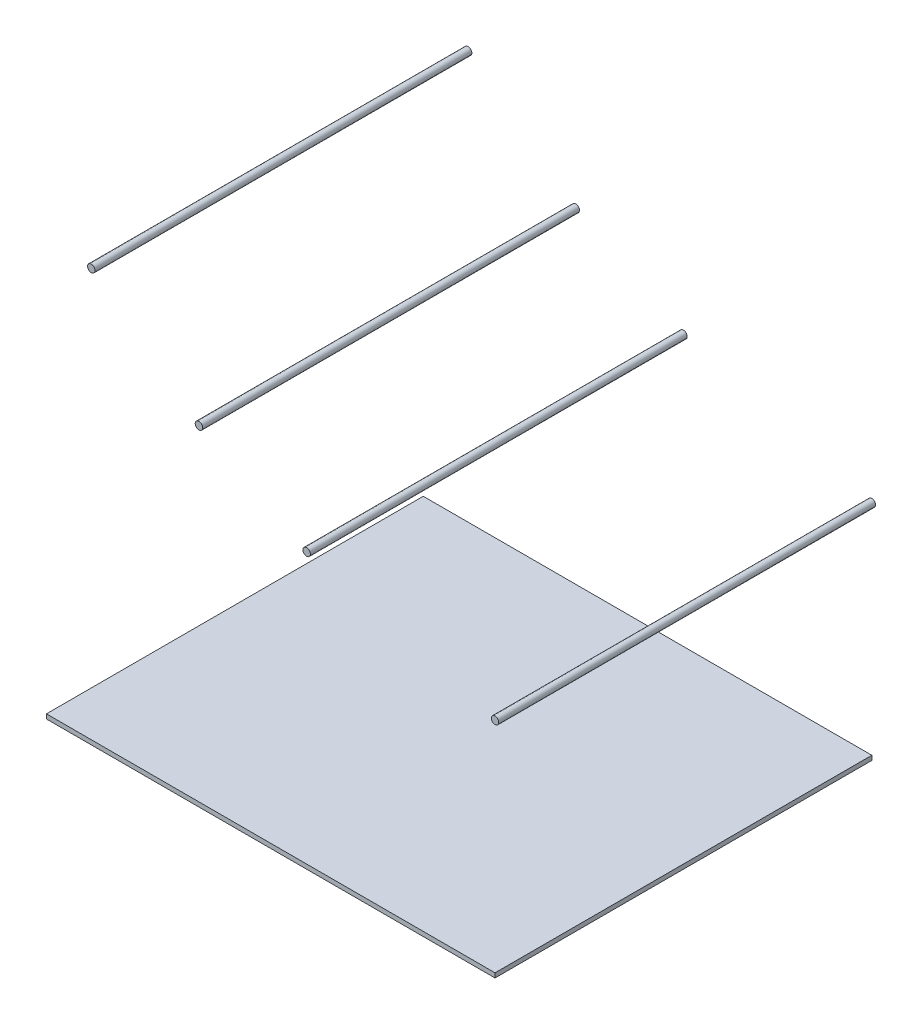
ISO-10303-21;
HEADER;
FILE_DESCRIPTION(('STEP AP214'),'2;1');
FILE_NAME('part.step','',(''),(''),'','','');
FILE_SCHEMA(('AUTOMOTIVE_DESIGN { 1 0 10303 214 1 1 1 1 }'));
ENDSEC;
DATA;
#1=APPLICATION_CONTEXT('core data for automotive mechanical design processes');
#2=APPLICATION_PROTOCOL_DEFINITION('international standard','automotive_design',2000,#1);
#3=PRODUCT_CONTEXT('',#1,'mechanical');
#4=PRODUCT('Part','Part','',(#3));
#5=PRODUCT_RELATED_PRODUCT_CATEGORY('part','',(#4));
#6=PRODUCT_DEFINITION_FORMATION('','',#4);
#7=PRODUCT_DEFINITION_CONTEXT('part definition',#1,'design');
#8=PRODUCT_DEFINITION('design','',#6,#7);
#9=PRODUCT_DEFINITION_SHAPE('','',#8);
#10=(LENGTH_UNIT() NAMED_UNIT(*) SI_UNIT(.MILLI.,.METRE.));
#11=(NAMED_UNIT(*) PLANE_ANGLE_UNIT() SI_UNIT($,.RADIAN.));
#12=(NAMED_UNIT(*) SI_UNIT($,.STERADIAN.) SOLID_ANGLE_UNIT());
#13=UNCERTAINTY_MEASURE_WITH_UNIT(LENGTH_MEASURE(1.E-05),#10,'distance_accuracy_value','');
#14=(GEOMETRIC_REPRESENTATION_CONTEXT(3) GLOBAL_UNCERTAINTY_ASSIGNED_CONTEXT((#13)) GLOBAL_UNIT_ASSIGNED_CONTEXT((#10,
#11,#12)) REPRESENTATION_CONTEXT('',''));
#15=CARTESIAN_POINT('',(0.,0.,0.));
#16=DIRECTION('',(0.,0.,1.));
#17=DIRECTION('',(1.,0.,0.));
#18=AXIS2_PLACEMENT_3D('',#15,#16,#17);
#19=CARTESIAN_POINT('',(0.,0.,1066.8));
#20=DIRECTION('',(-1.,0.,0.));
#21=DIRECTION('',(0.,-1.,0.));
#22=AXIS2_PLACEMENT_3D('',#19,#20,#21);
#23=PLANE('',#22);
#24=DIRECTION('',(0.,1.,0.));
#25=VECTOR('',#24,1.);
#26=CARTESIAN_POINT('',(0.,0.,-1066.8));
#27=LINE('',#26,#25);
#28=CARTESIAN_POINT('',(0.,-25.4,-1066.8));
#29=VERTEX_POINT('',#28);
#30=CARTESIAN_POINT('',(0.,0.,-1066.8));
#31=VERTEX_POINT('',#30);
#32=EDGE_CURVE('E108',#29,#31,#27,.T.);
#33=ORIENTED_EDGE('',*,*,#32,.T.);
#34=DIRECTION('',(0.,0.,-1.));
#35=VECTOR('',#34,1.);
#36=CARTESIAN_POINT('',(0.,0.,1066.8));
#37=LINE('',#36,#35);
#38=CARTESIAN_POINT('',(0.,0.,1066.8));
#39=VERTEX_POINT('',#38);
#40=EDGE_CURVE('E12',#39,#31,#37,.T.);
#41=ORIENTED_EDGE('',*,*,#40,.F.);
#42=DIRECTION('',(0.,1.,0.));
#43=VECTOR('',#42,1.);
#44=CARTESIAN_POINT('',(0.,0.,1066.8));
#45=LINE('',#44,#43);
#46=CARTESIAN_POINT('',(0.,-25.4,1066.8));
#47=VERTEX_POINT('',#46);
#48=EDGE_CURVE('E96',#47,#39,#45,.T.);
#49=ORIENTED_EDGE('',*,*,#48,.F.);
#50=DIRECTION('',(0.,0.,-1.));
#51=VECTOR('',#50,1.);
#52=CARTESIAN_POINT('',(0.,-25.4,1066.8));
#53=LINE('',#52,#51);
#54=EDGE_CURVE('E104',#47,#29,#53,.T.);
#55=ORIENTED_EDGE('',*,*,#54,.T.);
#56=EDGE_LOOP('',(#33,#41,#49,#55));
#57=FACE_BOUND('',#56,.T.);
#58=ADVANCED_FACE('F45',(#57),#23,.F.);
#59=CARTESIAN_POINT('',(0.,0.,1066.8));
#60=DIRECTION('',(0.,-1.,0.));
#61=DIRECTION('',(1.,0.,0.));
#62=AXIS2_PLACEMENT_3D('',#59,#60,#61);
#63=PLANE('',#62);
#64=DIRECTION('',(-1.,0.,0.));
#65=VECTOR('',#64,1.);
#66=CARTESIAN_POINT('',(0.,0.,-1066.8));
#67=LINE('',#66,#65);
#68=CARTESIAN_POINT('',(-2540.,-3.11060286983428E-13,-1066.8));
#69=VERTEX_POINT('',#68);
#70=EDGE_CURVE('E100',#31,#69,#67,.T.);
#71=ORIENTED_EDGE('',*,*,#70,.T.);
#72=DIRECTION('',(0.,0.,-1.));
#73=VECTOR('',#72,1.);
#74=CARTESIAN_POINT('',(-2540.,-3.11060286983428E-13,1066.8));
#75=LINE('',#74,#73);
#76=CARTESIAN_POINT('',(-2540.,-3.11060286983428E-13,1066.8));
#77=VERTEX_POINT('',#76);
#78=EDGE_CURVE('E53',#77,#69,#75,.T.);
#79=ORIENTED_EDGE('',*,*,#78,.F.);
#80=DIRECTION('',(-1.,0.,0.));
#81=VECTOR('',#80,1.);
#82=CARTESIAN_POINT('',(0.,0.,1066.8));
#83=LINE('',#82,#81);
#84=EDGE_CURVE('E91',#39,#77,#83,.T.);
#85=ORIENTED_EDGE('',*,*,#84,.F.);
#86=ORIENTED_EDGE('',*,*,#40,.T.);
#87=EDGE_LOOP('',(#71,#79,#85,#86));
#88=FACE_BOUND('',#87,.T.);
#89=ADVANCED_FACE('F99',(#88),#63,.F.);
#90=CARTESIAN_POINT('',(-2540.,-3.11060286983428E-13,1066.8));
#91=DIRECTION('',(1.,0.,0.));
#92=DIRECTION('',(0.,0.,-1.));
#93=AXIS2_PLACEMENT_3D('',#90,#91,#92);
#94=PLANE('',#93);
#95=DIRECTION('',(0.,-1.,0.));
#96=VECTOR('',#95,1.);
#97=CARTESIAN_POINT('',(-2540.,-3.11060286983428E-13,-1066.8));
#98=LINE('',#97,#96);
#99=CARTESIAN_POINT('',(-2540.,-25.4000000000003,-1066.8));
#100=VERTEX_POINT('',#99);
#101=EDGE_CURVE('E78',#69,#100,#98,.T.);
#102=ORIENTED_EDGE('',*,*,#101,.T.);
#103=DIRECTION('',(0.,0.,-1.));
#104=VECTOR('',#103,1.);
#105=CARTESIAN_POINT('',(-2540.,-25.4000000000003,1066.8));
#106=LINE('',#105,#104);
#107=CARTESIAN_POINT('',(-2540.,-25.4000000000003,1066.8));
#108=VERTEX_POINT('',#107);
#109=EDGE_CURVE('E101',#108,#100,#106,.T.);
#110=ORIENTED_EDGE('',*,*,#109,.F.);
#111=DIRECTION('',(0.,-1.,0.));
#112=VECTOR('',#111,1.);
#113=CARTESIAN_POINT('',(-2540.,-3.11060286983428E-13,1066.8));
#114=LINE('',#113,#112);
#115=EDGE_CURVE('E94',#77,#108,#114,.T.);
#116=ORIENTED_EDGE('',*,*,#115,.F.);
#117=ORIENTED_EDGE('',*,*,#78,.T.);
#118=EDGE_LOOP('',(#102,#110,#116,#117));
#119=FACE_BOUND('',#118,.T.);
#120=ADVANCED_FACE('F102',(#119),#94,.F.);
#121=CARTESIAN_POINT('',(0.,-25.4,1066.8));
#122=DIRECTION('',(0.,1.,0.));
#123=DIRECTION('',(-1.,0.,0.));
#124=AXIS2_PLACEMENT_3D('',#121,#122,#123);
#125=PLANE('',#124);
#126=DIRECTION('',(1.,0.,0.));
#127=VECTOR('',#126,1.);
#128=CARTESIAN_POINT('',(0.,-25.4,-1066.8));
#129=LINE('',#128,#127);
#130=EDGE_CURVE('E84',#100,#29,#129,.T.);
#131=ORIENTED_EDGE('',*,*,#130,.T.);
#132=ORIENTED_EDGE('',*,*,#54,.F.);
#133=DIRECTION('',(1.,0.,0.));
#134=VECTOR('',#133,1.);
#135=CARTESIAN_POINT('',(0.,-25.4,1066.8));
#136=LINE('',#135,#134);
#137=EDGE_CURVE('E61',#108,#47,#136,.T.);
#138=ORIENTED_EDGE('',*,*,#137,.F.);
#139=ORIENTED_EDGE('',*,*,#109,.T.);
#140=EDGE_LOOP('',(#131,#132,#138,#139));
#141=FACE_BOUND('',#140,.T.);
#142=ADVANCED_FACE('F115',(#141),#125,.F.);
#143=CARTESIAN_POINT('',(0.,0.,1066.8));
#144=DIRECTION('',(0.,0.,-1.));
#145=DIRECTION('',(-1.,0.,0.));
#146=AXIS2_PLACEMENT_3D('',#143,#144,#145);
#147=PLANE('',#146);
#148=ORIENTED_EDGE('',*,*,#48,.T.);
#149=ORIENTED_EDGE('',*,*,#84,.T.);
#150=ORIENTED_EDGE('',*,*,#115,.T.);
#151=ORIENTED_EDGE('',*,*,#137,.T.);
#152=EDGE_LOOP('',(#148,#149,#150,#151));
#153=FACE_BOUND('',#152,.T.);
#154=ADVANCED_FACE('F92',(#153),#147,.F.);
#155=CARTESIAN_POINT('',(0.,0.,-1066.8));
#156=DIRECTION('',(0.,0.,-1.));
#157=DIRECTION('',(-1.,0.,0.));
#158=AXIS2_PLACEMENT_3D('',#155,#156,#157);
#159=PLANE('',#158);
#160=ORIENTED_EDGE('',*,*,#32,.F.);
#161=ORIENTED_EDGE('',*,*,#130,.F.);
#162=ORIENTED_EDGE('',*,*,#101,.F.);
#163=ORIENTED_EDGE('',*,*,#70,.F.);
#164=EDGE_LOOP('',(#160,#161,#162,#163));
#165=FACE_BOUND('',#164,.T.);
#166=ADVANCED_FACE('F118',(#165),#159,.T.);
#167=CLOSED_SHELL('',(#58,#89,#120,#142,#154,#166));
#168=MANIFOLD_SOLID_BREP('B2',#167);
#169=CARTESIAN_POINT('',(-2286.,2311.4,1066.8));
#170=DIRECTION('',(0.,0.,-1.));
#171=DIRECTION('',(-1.,0.,0.));
#172=AXIS2_PLACEMENT_3D('',#169,#170,#171);
#173=CYLINDRICAL_SURFACE('',#172,21.0819999999999);
#174=CARTESIAN_POINT('',(-2286.,2311.4,1066.8));
#175=DIRECTION('',(0.,0.,1.));
#176=DIRECTION('',(1.,0.,0.));
#177=AXIS2_PLACEMENT_3D('',#174,#175,#176);
#178=CIRCLE('',#177,21.0819999999999);
#179=CARTESIAN_POINT('',(-2264.918,2311.4,1066.8));
#180=VERTEX_POINT('',#179);
#181=EDGE_CURVE('E44',#180,#180,#178,.T.);
#182=ORIENTED_EDGE('',*,*,#181,.F.);
#183=EDGE_LOOP('',(#182));
#184=FACE_BOUND('',#183,.T.);
#185=CARTESIAN_POINT('',(-2286.,2311.4,-1066.8));
#186=DIRECTION('',(0.,0.,1.));
#187=DIRECTION('',(1.,0.,0.));
#188=AXIS2_PLACEMENT_3D('',#185,#186,#187);
#189=CIRCLE('',#188,21.0819999999999);
#190=CARTESIAN_POINT('',(-2264.918,2311.4,-1066.8));
#191=VERTEX_POINT('',#190);
#192=EDGE_CURVE('E179',#191,#191,#189,.T.);
#193=ORIENTED_EDGE('',*,*,#192,.T.);
#194=EDGE_LOOP('',(#193));
#195=FACE_BOUND('',#194,.T.);
#196=ADVANCED_FACE('F176',(#184,#195),#173,.T.);
#197=CARTESIAN_POINT('',(-2286.,2311.4,1066.8));
#198=DIRECTION('',(0.,0.,1.));
#199=DIRECTION('',(1.,0.,0.));
#200=AXIS2_PLACEMENT_3D('',#197,#198,#199);
#201=PLANE('',#200);
#202=ORIENTED_EDGE('',*,*,#181,.T.);
#203=EDGE_LOOP('',(#202));
#204=FACE_BOUND('',#203,.T.);
#205=ADVANCED_FACE('F191',(#204),#201,.T.);
#206=CARTESIAN_POINT('',(-2286.,2311.4,-1066.8));
#207=DIRECTION('',(0.,0.,1.));
#208=DIRECTION('',(1.,0.,0.));
#209=AXIS2_PLACEMENT_3D('',#206,#207,#208);
#210=PLANE('',#209);
#211=ORIENTED_EDGE('',*,*,#192,.F.);
#212=EDGE_LOOP('',(#211));
#213=FACE_BOUND('',#212,.T.);
#214=ADVANCED_FACE('F189',(#213),#210,.F.);
#215=CLOSED_SHELL('',(#196,#205,#214));
#216=MANIFOLD_SOLID_BREP('B6',#215);
#217=CARTESIAN_POINT('',(-1676.4,1844.675,1066.8));
#218=DIRECTION('',(0.,0.,-1.));
#219=DIRECTION('',(-1.,0.,0.));
#220=AXIS2_PLACEMENT_3D('',#217,#218,#219);
#221=CYLINDRICAL_SURFACE('',#220,21.0819999999998);
#222=CARTESIAN_POINT('',(-1676.4,1844.675,1066.8));
#223=DIRECTION('',(0.,0.,1.));
#224=DIRECTION('',(1.,0.,0.));
#225=AXIS2_PLACEMENT_3D('',#222,#223,#224);
#226=CIRCLE('',#225,21.0819999999998);
#227=CARTESIAN_POINT('',(-1655.318,1844.675,1066.8));
#228=VERTEX_POINT('',#227);
#229=EDGE_CURVE('E175',#228,#228,#226,.T.);
#230=ORIENTED_EDGE('',*,*,#229,.F.);
#231=EDGE_LOOP('',(#230));
#232=FACE_BOUND('',#231,.T.);
#233=CARTESIAN_POINT('',(-1676.4,1844.675,-1066.8));
#234=DIRECTION('',(0.,0.,1.));
#235=DIRECTION('',(1.,0.,0.));
#236=AXIS2_PLACEMENT_3D('',#233,#234,#235);
#237=CIRCLE('',#236,21.0819999999998);
#238=CARTESIAN_POINT('',(-1655.318,1844.675,-1066.8));
#239=VERTEX_POINT('',#238);
#240=EDGE_CURVE('E227',#239,#239,#237,.T.);
#241=ORIENTED_EDGE('',*,*,#240,.T.);
#242=EDGE_LOOP('',(#241));
#243=FACE_BOUND('',#242,.T.);
#244=ADVANCED_FACE('F224',(#232,#243),#221,.T.);
#245=CARTESIAN_POINT('',(-1676.4,1844.675,1066.8));
#246=DIRECTION('',(0.,0.,1.));
#247=DIRECTION('',(1.,0.,0.));
#248=AXIS2_PLACEMENT_3D('',#245,#246,#247);
#249=PLANE('',#248);
#250=ORIENTED_EDGE('',*,*,#229,.T.);
#251=EDGE_LOOP('',(#250));
#252=FACE_BOUND('',#251,.T.);
#253=ADVANCED_FACE('F240',(#252),#249,.T.);
#254=CARTESIAN_POINT('',(-1676.4,1844.675,-1066.8));
#255=DIRECTION('',(0.,0.,1.));
#256=DIRECTION('',(1.,0.,0.));
#257=AXIS2_PLACEMENT_3D('',#254,#255,#256);
#258=PLANE('',#257);
#259=ORIENTED_EDGE('',*,*,#240,.F.);
#260=EDGE_LOOP('',(#259));
#261=FACE_BOUND('',#260,.T.);
#262=ADVANCED_FACE('F238',(#261),#258,.F.);
#263=CLOSED_SHELL('',(#244,#253,#262));
#264=MANIFOLD_SOLID_BREP('B39',#263);
#265=CARTESIAN_POINT('',(-1066.8,1530.35,1066.8));
#266=DIRECTION('',(0.,0.,-1.));
#267=DIRECTION('',(-1.,0.,0.));
#268=AXIS2_PLACEMENT_3D('',#265,#266,#267);
#269=CYLINDRICAL_SURFACE('',#268,21.0819999999998);
#270=CARTESIAN_POINT('',(-1066.8,1530.35,1066.8));
#271=DIRECTION('',(0.,0.,1.));
#272=DIRECTION('',(1.,0.,0.));
#273=AXIS2_PLACEMENT_3D('',#270,#271,#272);
#274=CIRCLE('',#273,21.0819999999998);
#275=CARTESIAN_POINT('',(-1045.718,1530.35,1066.8));
#276=VERTEX_POINT('',#275);
#277=EDGE_CURVE('E223',#276,#276,#274,.T.);
#278=ORIENTED_EDGE('',*,*,#277,.F.);
#279=EDGE_LOOP('',(#278));
#280=FACE_BOUND('',#279,.T.);
#281=CARTESIAN_POINT('',(-1066.8,1530.35,-1066.8));
#282=DIRECTION('',(0.,0.,1.));
#283=DIRECTION('',(1.,0.,0.));
#284=AXIS2_PLACEMENT_3D('',#281,#282,#283);
#285=CIRCLE('',#284,21.0819999999998);
#286=CARTESIAN_POINT('',(-1045.718,1530.35,-1066.8));
#287=VERTEX_POINT('',#286);
#288=EDGE_CURVE('E275',#287,#287,#285,.T.);
#289=ORIENTED_EDGE('',*,*,#288,.T.);
#290=EDGE_LOOP('',(#289));
#291=FACE_BOUND('',#290,.T.);
#292=ADVANCED_FACE('F272',(#280,#291),#269,.T.);
#293=CARTESIAN_POINT('',(-1066.8,1530.35,1066.8));
#294=DIRECTION('',(0.,0.,1.));
#295=DIRECTION('',(1.,0.,0.));
#296=AXIS2_PLACEMENT_3D('',#293,#294,#295);
#297=PLANE('',#296);
#298=ORIENTED_EDGE('',*,*,#277,.T.);
#299=EDGE_LOOP('',(#298));
#300=FACE_BOUND('',#299,.T.);
#301=ADVANCED_FACE('F289',(#300),#297,.T.);
#302=CARTESIAN_POINT('',(-1066.8,1530.35,-1066.8));
#303=DIRECTION('',(0.,0.,1.));
#304=DIRECTION('',(1.,0.,0.));
#305=AXIS2_PLACEMENT_3D('',#302,#303,#304);
#306=PLANE('',#305);
#307=ORIENTED_EDGE('',*,*,#288,.F.);
#308=EDGE_LOOP('',(#307));
#309=FACE_BOUND('',#308,.T.);
#310=ADVANCED_FACE('F287',(#309),#306,.F.);
#311=CLOSED_SHELL('',(#292,#301,#310));
#312=MANIFOLD_SOLID_BREP('B170',#311);
#313=CARTESIAN_POINT('',(0.,1238.25,1066.8));
#314=DIRECTION('',(0.,0.,-1.));
#315=DIRECTION('',(-1.,0.,0.));
#316=AXIS2_PLACEMENT_3D('',#313,#314,#315);
#317=CYLINDRICAL_SURFACE('',#316,21.082);
#318=CARTESIAN_POINT('',(0.,1238.25,1066.8));
#319=DIRECTION('',(0.,0.,1.));
#320=DIRECTION('',(1.,0.,0.));
#321=AXIS2_PLACEMENT_3D('',#318,#319,#320);
#322=CIRCLE('',#321,21.082);
#323=CARTESIAN_POINT('',(21.082,1238.25,1066.8));
#324=VERTEX_POINT('',#323);
#325=EDGE_CURVE('E271',#324,#324,#322,.T.);
#326=ORIENTED_EDGE('',*,*,#325,.F.);
#327=EDGE_LOOP('',(#326));
#328=FACE_BOUND('',#327,.T.);
#329=CARTESIAN_POINT('',(0.,1238.25,-1066.8));
#330=DIRECTION('',(0.,0.,1.));
#331=DIRECTION('',(1.,0.,0.));
#332=AXIS2_PLACEMENT_3D('',#329,#330,#331);
#333=CIRCLE('',#332,21.082);
#334=CARTESIAN_POINT('',(21.082,1238.25,-1066.8));
#335=VERTEX_POINT('',#334);
#336=EDGE_CURVE('E319',#335,#335,#333,.T.);
#337=ORIENTED_EDGE('',*,*,#336,.T.);
#338=EDGE_LOOP('',(#337));
#339=FACE_BOUND('',#338,.T.);
#340=ADVANCED_FACE('F316',(#328,#339),#317,.T.);
#341=CARTESIAN_POINT('',(0.,1238.25,1066.8));
#342=DIRECTION('',(0.,0.,1.));
#343=DIRECTION('',(1.,0.,0.));
#344=AXIS2_PLACEMENT_3D('',#341,#342,#343);
#345=PLANE('',#344);
#346=ORIENTED_EDGE('',*,*,#325,.T.);
#347=EDGE_LOOP('',(#346));
#348=FACE_BOUND('',#347,.T.);
#349=ADVANCED_FACE('F331',(#348),#345,.T.);
#350=CARTESIAN_POINT('',(0.,1238.25,-1066.8));
#351=DIRECTION('',(0.,0.,1.));
#352=DIRECTION('',(1.,0.,0.));
#353=AXIS2_PLACEMENT_3D('',#350,#351,#352);
#354=PLANE('',#353);
#355=ORIENTED_EDGE('',*,*,#336,.F.);
#356=EDGE_LOOP('',(#355));
#357=FACE_BOUND('',#356,.T.);
#358=ADVANCED_FACE('F329',(#357),#354,.F.);
#359=CLOSED_SHELL('',(#340,#349,#358));
#360=MANIFOLD_SOLID_BREP('B218',#359);
#361=ADVANCED_BREP_SHAPE_REPRESENTATION('',(#18,#168,#216,#264,#312,#360),#14);
#362=SHAPE_DEFINITION_REPRESENTATION(#9,#361);
ENDSEC;
END-ISO-10303-21;
